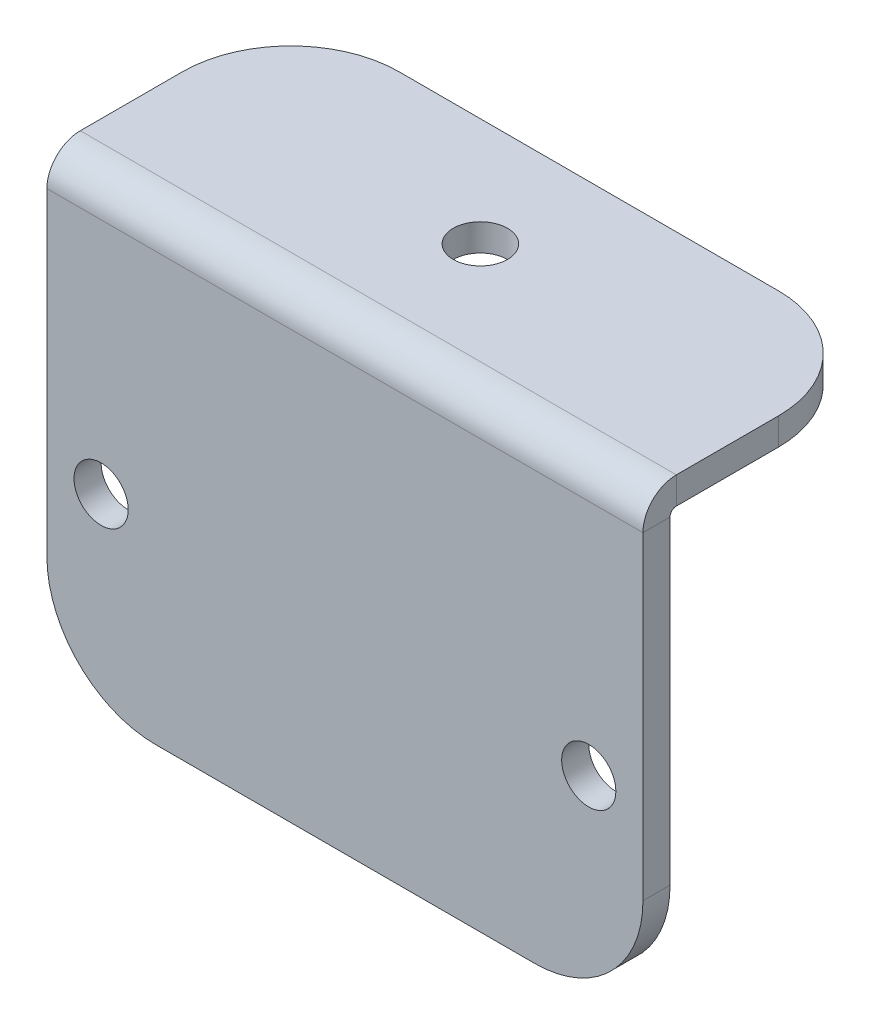
ISO-10303-21;
HEADER;
FILE_DESCRIPTION(('STEP AP214'),'2;1');
FILE_NAME('part.step','',(''),(''),'','','');
FILE_SCHEMA(('AUTOMOTIVE_DESIGN { 1 0 10303 214 1 1 1 1 }'));
ENDSEC;
DATA;
#1=APPLICATION_CONTEXT('core data for automotive mechanical design processes');
#2=APPLICATION_PROTOCOL_DEFINITION('international standard','automotive_design',2000,#1);
#3=PRODUCT_CONTEXT('',#1,'mechanical');
#4=PRODUCT('Part','Part','',(#3));
#5=PRODUCT_RELATED_PRODUCT_CATEGORY('part','',(#4));
#6=PRODUCT_DEFINITION_FORMATION('','',#4);
#7=PRODUCT_DEFINITION_CONTEXT('part definition',#1,'design');
#8=PRODUCT_DEFINITION('design','',#6,#7);
#9=PRODUCT_DEFINITION_SHAPE('','',#8);
#10=(LENGTH_UNIT() NAMED_UNIT(*) SI_UNIT(.MILLI.,.METRE.));
#11=(NAMED_UNIT(*) PLANE_ANGLE_UNIT() SI_UNIT($,.RADIAN.));
#12=(NAMED_UNIT(*) SI_UNIT($,.STERADIAN.) SOLID_ANGLE_UNIT());
#13=UNCERTAINTY_MEASURE_WITH_UNIT(LENGTH_MEASURE(1.E-05),#10,'distance_accuracy_value','');
#14=(GEOMETRIC_REPRESENTATION_CONTEXT(3) GLOBAL_UNCERTAINTY_ASSIGNED_CONTEXT((#13)) GLOBAL_UNIT_ASSIGNED_CONTEXT((#10,
#11,#12)) REPRESENTATION_CONTEXT('',''));
#15=CARTESIAN_POINT('',(0.,0.,0.));
#16=DIRECTION('',(0.,0.,1.));
#17=DIRECTION('',(1.,0.,0.));
#18=AXIS2_PLACEMENT_3D('',#15,#16,#17);
#19=CARTESIAN_POINT('',(34.925,-0.7366,0.));
#20=DIRECTION('',(1.,0.,0.));
#21=DIRECTION('',(0.,0.,-1.));
#22=AXIS2_PLACEMENT_3D('',#19,#20,#21);
#23=PLANE('',#22);
#24=DIRECTION('',(0.,0.,1.));
#25=VECTOR('',#24,1.);
#26=CARTESIAN_POINT('',(34.925,-0.7366,0.));
#27=LINE('',#26,#25);
#28=CARTESIAN_POINT('',(34.925,-0.7366,0.));
#29=VERTEX_POINT('',#28);
#30=CARTESIAN_POINT('',(34.925,-0.736600000000001,3.175));
#31=VERTEX_POINT('',#30);
#32=EDGE_CURVE('E132',#29,#31,#27,.T.);
#33=ORIENTED_EDGE('',*,*,#32,.F.);
#34=CARTESIAN_POINT('',(34.925,-0.7366,-0.7366));
#35=DIRECTION('',(-1.,0.,0.));
#36=DIRECTION('',(0.,0.,1.));
#37=AXIS2_PLACEMENT_3D('',#34,#35,#36);
#38=CIRCLE('',#37,0.7366);
#39=CARTESIAN_POINT('',(34.925,0.,-0.7366));
#40=VERTEX_POINT('',#39);
#41=EDGE_CURVE('E136',#40,#29,#38,.F.);
#42=ORIENTED_EDGE('',*,*,#41,.F.);
#43=DIRECTION('',(0.,-1.,0.));
#44=VECTOR('',#43,1.);
#45=CARTESIAN_POINT('',(34.925,3.175,-0.736600000000001));
#46=LINE('',#45,#44);
#47=CARTESIAN_POINT('',(34.925,3.175,-0.736600000000001));
#48=VERTEX_POINT('',#47);
#49=EDGE_CURVE('E141',#48,#40,#46,.T.);
#50=ORIENTED_EDGE('',*,*,#49,.F.);
#51=CARTESIAN_POINT('',(34.925,-0.7366,-0.7366));
#52=DIRECTION('',(1.,0.,0.));
#53=DIRECTION('',(0.,0.,-1.));
#54=AXIS2_PLACEMENT_3D('',#51,#52,#53);
#55=CIRCLE('',#54,3.9116);
#56=EDGE_CURVE('E138',#48,#31,#55,.T.);
#57=ORIENTED_EDGE('',*,*,#56,.T.);
#58=EDGE_LOOP('',(#33,#42,#50,#57));
#59=FACE_BOUND('',#58,.T.);
#60=ADVANCED_FACE('F39',(#59),#23,.T.);
#61=CARTESIAN_POINT('',(34.925,3.175,-0.736600000000001));
#62=DIRECTION('',(1.,0.,0.));
#63=DIRECTION('',(0.,0.,-1.));
#64=AXIS2_PLACEMENT_3D('',#61,#62,#63);
#65=PLANE('',#64);
#66=DIRECTION('',(0.,-1.,0.));
#67=VECTOR('',#66,1.);
#68=CARTESIAN_POINT('',(34.925,0.,3.175));
#69=LINE('',#68,#67);
#70=CARTESIAN_POINT('',(34.925,-38.1,3.17499999999999));
#71=VERTEX_POINT('',#70);
#72=EDGE_CURVE('E156',#31,#71,#69,.T.);
#73=ORIENTED_EDGE('',*,*,#72,.T.);
#74=DIRECTION('',(0.,0.,1.));
#75=VECTOR('',#74,1.);
#76=CARTESIAN_POINT('',(34.925,-38.1,-0.736600000000001));
#77=LINE('',#76,#75);
#78=CARTESIAN_POINT('',(34.925,-38.1,0.));
#79=VERTEX_POINT('',#78);
#80=EDGE_CURVE('E62',#71,#79,#77,.F.);
#81=ORIENTED_EDGE('',*,*,#80,.T.);
#82=DIRECTION('',(0.,-1.,0.));
#83=VECTOR('',#82,1.);
#84=CARTESIAN_POINT('',(34.925,0.,0.));
#85=LINE('',#84,#83);
#86=EDGE_CURVE('E146',#29,#79,#85,.T.);
#87=ORIENTED_EDGE('',*,*,#86,.F.);
#88=ORIENTED_EDGE('',*,*,#32,.T.);
#89=EDGE_LOOP('',(#73,#81,#87,#88));
#90=FACE_BOUND('',#89,.T.);
#91=ADVANCED_FACE('F155',(#90),#65,.T.);
#92=CARTESIAN_POINT('',(-34.925,0.,-0.7366));
#93=DIRECTION('',(-1.,0.,0.));
#94=DIRECTION('',(0.,0.,1.));
#95=AXIS2_PLACEMENT_3D('',#92,#93,#94);
#96=PLANE('',#95);
#97=DIRECTION('',(0.,1.,0.));
#98=VECTOR('',#97,1.);
#99=CARTESIAN_POINT('',(-34.925,0.,-0.7366));
#100=LINE('',#99,#98);
#101=CARTESIAN_POINT('',(-34.925,0.,-0.7366));
#102=VERTEX_POINT('',#101);
#103=CARTESIAN_POINT('',(-34.925,3.175,-0.736600000000001));
#104=VERTEX_POINT('',#103);
#105=EDGE_CURVE('E202',#102,#104,#100,.T.);
#106=ORIENTED_EDGE('',*,*,#105,.F.);
#107=CARTESIAN_POINT('',(-34.925,-0.7366,-0.7366));
#108=DIRECTION('',(-1.,0.,0.));
#109=DIRECTION('',(0.,0.,1.));
#110=AXIS2_PLACEMENT_3D('',#107,#108,#109);
#111=CIRCLE('',#110,0.7366);
#112=CARTESIAN_POINT('',(-34.925,-0.7366,0.));
#113=VERTEX_POINT('',#112);
#114=EDGE_CURVE('E175',#102,#113,#111,.F.);
#115=ORIENTED_EDGE('',*,*,#114,.T.);
#116=DIRECTION('',(0.,0.,-1.));
#117=VECTOR('',#116,1.);
#118=CARTESIAN_POINT('',(-34.925,-0.736600000000001,3.175));
#119=LINE('',#118,#117);
#120=CARTESIAN_POINT('',(-34.925,-0.736600000000001,3.175));
#121=VERTEX_POINT('',#120);
#122=EDGE_CURVE('E200',#121,#113,#119,.T.);
#123=ORIENTED_EDGE('',*,*,#122,.F.);
#124=CARTESIAN_POINT('',(-34.925,-0.7366,-0.7366));
#125=DIRECTION('',(1.,0.,0.));
#126=DIRECTION('',(0.,0.,-1.));
#127=AXIS2_PLACEMENT_3D('',#124,#125,#126);
#128=CIRCLE('',#127,3.9116);
#129=EDGE_CURVE('E181',#104,#121,#128,.T.);
#130=ORIENTED_EDGE('',*,*,#129,.F.);
#131=EDGE_LOOP('',(#106,#115,#123,#130));
#132=FACE_BOUND('',#131,.T.);
#133=ADVANCED_FACE('F299',(#132),#96,.T.);
#134=CARTESIAN_POINT('',(-34.925,-0.736600000000001,3.175));
#135=DIRECTION('',(-1.,0.,0.));
#136=DIRECTION('',(0.,0.,1.));
#137=AXIS2_PLACEMENT_3D('',#134,#135,#136);
#138=PLANE('',#137);
#139=DIRECTION('',(0.,0.,-1.));
#140=VECTOR('',#139,1.);
#141=CARTESIAN_POINT('',(-34.925,3.175,-25.4));
#142=LINE('',#141,#140);
#143=CARTESIAN_POINT('',(-34.925,3.175,-12.7));
#144=VERTEX_POINT('',#143);
#145=EDGE_CURVE('E179',#144,#104,#142,.F.);
#146=ORIENTED_EDGE('',*,*,#145,.F.);
#147=DIRECTION('',(0.,-1.,0.));
#148=VECTOR('',#147,1.);
#149=CARTESIAN_POINT('',(-34.925,-0.736600000000001,-12.7));
#150=LINE('',#149,#148);
#151=CARTESIAN_POINT('',(-34.925,0.,-12.7));
#152=VERTEX_POINT('',#151);
#153=EDGE_CURVE('E228',#144,#152,#150,.T.);
#154=ORIENTED_EDGE('',*,*,#153,.T.);
#155=DIRECTION('',(0.,0.,1.));
#156=VECTOR('',#155,1.);
#157=CARTESIAN_POINT('',(-34.925,0.,-25.4));
#158=LINE('',#157,#156);
#159=EDGE_CURVE('E177',#152,#102,#158,.T.);
#160=ORIENTED_EDGE('',*,*,#159,.T.);
#161=ORIENTED_EDGE('',*,*,#105,.T.);
#162=EDGE_LOOP('',(#146,#154,#160,#161));
#163=FACE_BOUND('',#162,.T.);
#164=ADVANCED_FACE('F294',(#163),#138,.T.);
#165=CARTESIAN_POINT('',(34.925,0.,3.175));
#166=DIRECTION('',(0.,0.,-1.));
#167=DIRECTION('',(0.,1.,0.));
#168=AXIS2_PLACEMENT_3D('',#165,#166,#167);
#169=PLANE('',#168);
#170=CARTESIAN_POINT('',(28.575,-28.575,3.175));
#171=DIRECTION('',(0.,0.,1.));
#172=DIRECTION('',(1.,0.,0.));
#173=AXIS2_PLACEMENT_3D('',#170,#171,#172);
#174=CIRCLE('',#173,3.175);
#175=CARTESIAN_POINT('',(31.75,-28.575,3.175));
#176=VERTEX_POINT('',#175);
#177=EDGE_CURVE('E213',#176,#176,#174,.T.);
#178=ORIENTED_EDGE('',*,*,#177,.F.);
#179=EDGE_LOOP('',(#178));
#180=FACE_BOUND('',#179,.T.);
#181=CARTESIAN_POINT('',(-28.575,-28.575,3.175));
#182=DIRECTION('',(0.,0.,1.));
#183=DIRECTION('',(1.,0.,0.));
#184=AXIS2_PLACEMENT_3D('',#181,#182,#183);
#185=CIRCLE('',#184,3.175);
#186=CARTESIAN_POINT('',(-25.4,-28.575,3.175));
#187=VERTEX_POINT('',#186);
#188=EDGE_CURVE('E209',#187,#187,#185,.T.);
#189=ORIENTED_EDGE('',*,*,#188,.F.);
#190=EDGE_LOOP('',(#189));
#191=FACE_BOUND('',#190,.T.);
#192=DIRECTION('',(-1.,0.,0.));
#193=VECTOR('',#192,1.);
#194=CARTESIAN_POINT('',(34.925,-50.8,3.17499999999999));
#195=LINE('',#194,#193);
#196=CARTESIAN_POINT('',(22.225,-50.8,3.17499999999999));
#197=VERTEX_POINT('',#196);
#198=CARTESIAN_POINT('',(-22.225,-50.8,3.17499999999999));
#199=VERTEX_POINT('',#198);
#200=EDGE_CURVE('E197',#197,#199,#195,.T.);
#201=ORIENTED_EDGE('',*,*,#200,.F.);
#202=CARTESIAN_POINT('',(22.225,-38.1,3.17499999999999));
#203=DIRECTION('',(0.,0.,-1.));
#204=DIRECTION('',(0.,1.,0.));
#205=AXIS2_PLACEMENT_3D('',#202,#203,#204);
#206=CIRCLE('',#205,12.7);
#207=EDGE_CURVE('E238',#197,#71,#206,.F.);
#208=ORIENTED_EDGE('',*,*,#207,.T.);
#209=ORIENTED_EDGE('',*,*,#72,.F.);
#210=DIRECTION('',(-1.,0.,0.));
#211=VECTOR('',#210,1.);
#212=CARTESIAN_POINT('',(34.925,-0.736600000000001,3.175));
#213=LINE('',#212,#211);
#214=EDGE_CURVE('E169',#31,#121,#213,.T.);
#215=ORIENTED_EDGE('',*,*,#214,.T.);
#216=DIRECTION('',(0.,-1.,0.));
#217=VECTOR('',#216,1.);
#218=CARTESIAN_POINT('',(-34.925,0.,3.175));
#219=LINE('',#218,#217);
#220=CARTESIAN_POINT('',(-34.925,-38.1,3.17499999999999));
#221=VERTEX_POINT('',#220);
#222=EDGE_CURVE('E170',#121,#221,#219,.T.);
#223=ORIENTED_EDGE('',*,*,#222,.T.);
#224=CARTESIAN_POINT('',(-22.225,-38.1,3.175));
#225=DIRECTION('',(0.,0.,-1.));
#226=DIRECTION('',(0.,1.,0.));
#227=AXIS2_PLACEMENT_3D('',#224,#225,#226);
#228=CIRCLE('',#227,12.7);
#229=EDGE_CURVE('E236',#221,#199,#228,.F.);
#230=ORIENTED_EDGE('',*,*,#229,.T.);
#231=EDGE_LOOP('',(#201,#208,#209,#215,#223,#230));
#232=FACE_BOUND('',#231,.T.);
#233=ADVANCED_FACE('F251',(#180,#191,#232),#169,.F.);
#234=CARTESIAN_POINT('',(34.925,-50.8,0.));
#235=DIRECTION('',(0.,-1.,0.));
#236=DIRECTION('',(0.,0.,-1.));
#237=AXIS2_PLACEMENT_3D('',#234,#235,#236);
#238=PLANE('',#237);
#239=DIRECTION('',(-1.,0.,0.));
#240=VECTOR('',#239,1.);
#241=CARTESIAN_POINT('',(34.925,-50.8,0.));
#242=LINE('',#241,#240);
#243=CARTESIAN_POINT('',(22.225,-50.8,0.));
#244=VERTEX_POINT('',#243);
#245=CARTESIAN_POINT('',(-22.225,-50.8,0.));
#246=VERTEX_POINT('',#245);
#247=EDGE_CURVE('E152',#244,#246,#242,.T.);
#248=ORIENTED_EDGE('',*,*,#247,.F.);
#249=DIRECTION('',(0.,0.,1.));
#250=VECTOR('',#249,1.);
#251=CARTESIAN_POINT('',(22.225,-50.8,0.));
#252=LINE('',#251,#250);
#253=EDGE_CURVE('E233',#244,#197,#252,.T.);
#254=ORIENTED_EDGE('',*,*,#253,.T.);
#255=ORIENTED_EDGE('',*,*,#200,.T.);
#256=DIRECTION('',(0.,0.,1.));
#257=VECTOR('',#256,1.);
#258=CARTESIAN_POINT('',(-22.225,-50.8,0.));
#259=LINE('',#258,#257);
#260=EDGE_CURVE('E231',#199,#246,#259,.F.);
#261=ORIENTED_EDGE('',*,*,#260,.T.);
#262=EDGE_LOOP('',(#248,#254,#255,#261));
#263=FACE_BOUND('',#262,.T.);
#264=ADVANCED_FACE('F245',(#263),#238,.T.);
#265=CARTESIAN_POINT('',(34.925,0.,0.));
#266=DIRECTION('',(0.,0.,-1.));
#267=DIRECTION('',(0.,1.,0.));
#268=AXIS2_PLACEMENT_3D('',#265,#266,#267);
#269=PLANE('',#268);
#270=CARTESIAN_POINT('',(28.575,-28.575,0.));
#271=DIRECTION('',(0.,0.,-1.));
#272=DIRECTION('',(0.,1.,0.));
#273=AXIS2_PLACEMENT_3D('',#270,#271,#272);
#274=CIRCLE('',#273,3.175);
#275=CARTESIAN_POINT('',(28.575,-25.4,0.));
#276=VERTEX_POINT('',#275);
#277=EDGE_CURVE('E210',#276,#276,#274,.T.);
#278=ORIENTED_EDGE('',*,*,#277,.F.);
#279=EDGE_LOOP('',(#278));
#280=FACE_BOUND('',#279,.T.);
#281=CARTESIAN_POINT('',(-28.575,-28.575,0.));
#282=DIRECTION('',(0.,0.,-1.));
#283=DIRECTION('',(0.,1.,0.));
#284=AXIS2_PLACEMENT_3D('',#281,#282,#283);
#285=CIRCLE('',#284,3.175);
#286=CARTESIAN_POINT('',(-28.575,-25.4,0.));
#287=VERTEX_POINT('',#286);
#288=EDGE_CURVE('E173',#287,#287,#285,.T.);
#289=ORIENTED_EDGE('',*,*,#288,.F.);
#290=EDGE_LOOP('',(#289));
#291=FACE_BOUND('',#290,.T.);
#292=ORIENTED_EDGE('',*,*,#86,.T.);
#293=CARTESIAN_POINT('',(22.225,-38.1,0.));
#294=DIRECTION('',(0.,0.,-1.));
#295=DIRECTION('',(0.,1.,0.));
#296=AXIS2_PLACEMENT_3D('',#293,#294,#295);
#297=CIRCLE('',#296,12.7);
#298=EDGE_CURVE('E47',#79,#244,#297,.T.);
#299=ORIENTED_EDGE('',*,*,#298,.T.);
#300=ORIENTED_EDGE('',*,*,#247,.T.);
#301=CARTESIAN_POINT('',(-22.225,-38.1,0.));
#302=DIRECTION('',(0.,0.,-1.));
#303=DIRECTION('',(0.,1.,0.));
#304=AXIS2_PLACEMENT_3D('',#301,#302,#303);
#305=CIRCLE('',#304,12.7);
#306=CARTESIAN_POINT('',(-34.925,-38.1,0.));
#307=VERTEX_POINT('',#306);
#308=EDGE_CURVE('E54',#246,#307,#305,.T.);
#309=ORIENTED_EDGE('',*,*,#308,.T.);
#310=DIRECTION('',(0.,-1.,0.));
#311=VECTOR('',#310,1.);
#312=CARTESIAN_POINT('',(-34.925,0.,0.));
#313=LINE('',#312,#311);
#314=EDGE_CURVE('E148',#113,#307,#313,.T.);
#315=ORIENTED_EDGE('',*,*,#314,.F.);
#316=DIRECTION('',(-1.,0.,0.));
#317=VECTOR('',#316,1.);
#318=CARTESIAN_POINT('',(34.925,-0.7366,0.));
#319=LINE('',#318,#317);
#320=EDGE_CURVE('E144',#29,#113,#319,.T.);
#321=ORIENTED_EDGE('',*,*,#320,.F.);
#322=EDGE_LOOP('',(#292,#299,#300,#309,#315,#321));
#323=FACE_BOUND('',#322,.T.);
#324=ADVANCED_FACE('F145',(#280,#291,#323),#269,.T.);
#325=CARTESIAN_POINT('',(34.925,-0.7366,-0.7366));
#326=DIRECTION('',(-1.,0.,0.));
#327=DIRECTION('',(0.,0.,1.));
#328=AXIS2_PLACEMENT_3D('',#325,#326,#327);
#329=CYLINDRICAL_SURFACE('',#328,0.7366);
#330=ORIENTED_EDGE('',*,*,#114,.F.);
#331=DIRECTION('',(-1.,0.,0.));
#332=VECTOR('',#331,1.);
#333=CARTESIAN_POINT('',(34.925,0.,-0.7366));
#334=LINE('',#333,#332);
#335=EDGE_CURVE('E153',#40,#102,#334,.T.);
#336=ORIENTED_EDGE('',*,*,#335,.F.);
#337=ORIENTED_EDGE('',*,*,#41,.T.);
#338=ORIENTED_EDGE('',*,*,#320,.T.);
#339=EDGE_LOOP('',(#330,#336,#337,#338));
#340=FACE_BOUND('',#339,.T.);
#341=ADVANCED_FACE('F159',(#340),#329,.F.);
#342=CARTESIAN_POINT('',(34.925,0.,-25.4));
#343=DIRECTION('',(0.,-1.,0.));
#344=DIRECTION('',(0.,0.,-1.));
#345=AXIS2_PLACEMENT_3D('',#342,#343,#344);
#346=PLANE('',#345);
#347=CARTESIAN_POINT('',(0.,0.,-12.7));
#348=DIRECTION('',(0.,-1.,0.));
#349=DIRECTION('',(0.,0.,-1.));
#350=AXIS2_PLACEMENT_3D('',#347,#348,#349);
#351=CIRCLE('',#350,3.175);
#352=CARTESIAN_POINT('',(0.,0.,-15.875));
#353=VERTEX_POINT('',#352);
#354=EDGE_CURVE('E257',#353,#353,#351,.T.);
#355=ORIENTED_EDGE('',*,*,#354,.F.);
#356=EDGE_LOOP('',(#355));
#357=FACE_BOUND('',#356,.T.);
#358=DIRECTION('',(-1.,0.,0.));
#359=VECTOR('',#358,1.);
#360=CARTESIAN_POINT('',(34.925,0.,-25.4));
#361=LINE('',#360,#359);
#362=CARTESIAN_POINT('',(22.225,0.,-25.4));
#363=VERTEX_POINT('',#362);
#364=CARTESIAN_POINT('',(-22.225,0.,-25.4));
#365=VERTEX_POINT('',#364);
#366=EDGE_CURVE('E192',#363,#365,#361,.T.);
#367=ORIENTED_EDGE('',*,*,#366,.F.);
#368=CARTESIAN_POINT('',(22.225,0.,-12.7));
#369=DIRECTION('',(0.,-1.,0.));
#370=DIRECTION('',(0.,0.,-1.));
#371=AXIS2_PLACEMENT_3D('',#368,#369,#370);
#372=CIRCLE('',#371,12.7);
#373=CARTESIAN_POINT('',(34.925,0.,-12.7));
#374=VERTEX_POINT('',#373);
#375=EDGE_CURVE('E220',#363,#374,#372,.T.);
#376=ORIENTED_EDGE('',*,*,#375,.T.);
#377=DIRECTION('',(0.,0.,1.));
#378=VECTOR('',#377,1.);
#379=CARTESIAN_POINT('',(34.925,0.,-25.4));
#380=LINE('',#379,#378);
#381=EDGE_CURVE('E161',#374,#40,#380,.T.);
#382=ORIENTED_EDGE('',*,*,#381,.T.);
#383=ORIENTED_EDGE('',*,*,#335,.T.);
#384=ORIENTED_EDGE('',*,*,#159,.F.);
#385=CARTESIAN_POINT('',(-22.225,0.,-12.7));
#386=DIRECTION('',(0.,-1.,0.));
#387=DIRECTION('',(0.,0.,-1.));
#388=AXIS2_PLACEMENT_3D('',#385,#386,#387);
#389=CIRCLE('',#388,12.7);
#390=EDGE_CURVE('E218',#152,#365,#389,.T.);
#391=ORIENTED_EDGE('',*,*,#390,.T.);
#392=EDGE_LOOP('',(#367,#376,#382,#383,#384,#391));
#393=FACE_BOUND('',#392,.T.);
#394=ADVANCED_FACE('F285',(#357,#393),#346,.T.);
#395=CARTESIAN_POINT('',(34.925,3.175,-25.4));
#396=DIRECTION('',(0.,0.,-1.));
#397=DIRECTION('',(-1.,0.,0.));
#398=AXIS2_PLACEMENT_3D('',#395,#396,#397);
#399=PLANE('',#398);
#400=DIRECTION('',(-1.,0.,0.));
#401=VECTOR('',#400,1.);
#402=CARTESIAN_POINT('',(34.925,3.175,-25.4));
#403=LINE('',#402,#401);
#404=CARTESIAN_POINT('',(22.225,3.175,-25.4));
#405=VERTEX_POINT('',#404);
#406=CARTESIAN_POINT('',(-22.225,3.175,-25.4));
#407=VERTEX_POINT('',#406);
#408=EDGE_CURVE('E189',#405,#407,#403,.T.);
#409=ORIENTED_EDGE('',*,*,#408,.F.);
#410=DIRECTION('',(0.,-1.,0.));
#411=VECTOR('',#410,1.);
#412=CARTESIAN_POINT('',(22.225,0.,-25.4));
#413=LINE('',#412,#411);
#414=EDGE_CURVE('E215',#405,#363,#413,.T.);
#415=ORIENTED_EDGE('',*,*,#414,.T.);
#416=ORIENTED_EDGE('',*,*,#366,.T.);
#417=DIRECTION('',(0.,-1.,0.));
#418=VECTOR('',#417,1.);
#419=CARTESIAN_POINT('',(-22.225,3.175,-25.4));
#420=LINE('',#419,#418);
#421=EDGE_CURVE('E140',#365,#407,#420,.F.);
#422=ORIENTED_EDGE('',*,*,#421,.T.);
#423=EDGE_LOOP('',(#409,#415,#416,#422));
#424=FACE_BOUND('',#423,.T.);
#425=ADVANCED_FACE('F270',(#424),#399,.T.);
#426=CARTESIAN_POINT('',(34.925,3.175,-25.4));
#427=DIRECTION('',(0.,-1.,0.));
#428=DIRECTION('',(0.,0.,-1.));
#429=AXIS2_PLACEMENT_3D('',#426,#427,#428);
#430=PLANE('',#429);
#431=CARTESIAN_POINT('',(0.,3.175,-12.7));
#432=DIRECTION('',(0.,1.,0.));
#433=DIRECTION('',(0.,0.,1.));
#434=AXIS2_PLACEMENT_3D('',#431,#432,#433);
#435=CIRCLE('',#434,3.175);
#436=CARTESIAN_POINT('',(0.,3.175,-9.525));
#437=VERTEX_POINT('',#436);
#438=EDGE_CURVE('E260',#437,#437,#435,.T.);
#439=ORIENTED_EDGE('',*,*,#438,.F.);
#440=EDGE_LOOP('',(#439));
#441=FACE_BOUND('',#440,.T.);
#442=DIRECTION('',(0.,0.,-1.));
#443=VECTOR('',#442,1.);
#444=CARTESIAN_POINT('',(34.925,3.175,-25.4));
#445=LINE('',#444,#443);
#446=CARTESIAN_POINT('',(34.925,3.175,-12.7));
#447=VERTEX_POINT('',#446);
#448=EDGE_CURVE('E163',#447,#48,#445,.F.);
#449=ORIENTED_EDGE('',*,*,#448,.F.);
#450=CARTESIAN_POINT('',(22.225,3.175,-12.7));
#451=DIRECTION('',(0.,-1.,0.));
#452=DIRECTION('',(0.,0.,-1.));
#453=AXIS2_PLACEMENT_3D('',#450,#451,#452);
#454=CIRCLE('',#453,12.7);
#455=EDGE_CURVE('E226',#447,#405,#454,.F.);
#456=ORIENTED_EDGE('',*,*,#455,.T.);
#457=ORIENTED_EDGE('',*,*,#408,.T.);
#458=CARTESIAN_POINT('',(-22.225,3.175,-12.7));
#459=DIRECTION('',(0.,-1.,0.));
#460=DIRECTION('',(0.,0.,-1.));
#461=AXIS2_PLACEMENT_3D('',#458,#459,#460);
#462=CIRCLE('',#461,12.7);
#463=EDGE_CURVE('E224',#407,#144,#462,.F.);
#464=ORIENTED_EDGE('',*,*,#463,.T.);
#465=ORIENTED_EDGE('',*,*,#145,.T.);
#466=DIRECTION('',(-1.,0.,0.));
#467=VECTOR('',#466,1.);
#468=CARTESIAN_POINT('',(34.925,3.175,-0.736600000000001));
#469=LINE('',#468,#467);
#470=EDGE_CURVE('E186',#48,#104,#469,.T.);
#471=ORIENTED_EDGE('',*,*,#470,.F.);
#472=EDGE_LOOP('',(#449,#456,#457,#464,#465,#471));
#473=FACE_BOUND('',#472,.T.);
#474=ADVANCED_FACE('F266',(#441,#473),#430,.F.);
#475=CARTESIAN_POINT('',(34.925,-0.7366,-0.7366));
#476=DIRECTION('',(-1.,0.,0.));
#477=DIRECTION('',(0.,0.,1.));
#478=AXIS2_PLACEMENT_3D('',#475,#476,#477);
#479=CYLINDRICAL_SURFACE('',#478,3.9116);
#480=ORIENTED_EDGE('',*,*,#129,.T.);
#481=ORIENTED_EDGE('',*,*,#214,.F.);
#482=ORIENTED_EDGE('',*,*,#56,.F.);
#483=ORIENTED_EDGE('',*,*,#470,.T.);
#484=EDGE_LOOP('',(#480,#481,#482,#483));
#485=FACE_BOUND('',#484,.T.);
#486=ADVANCED_FACE('F269',(#485),#479,.T.);
#487=CARTESIAN_POINT('',(34.925,-0.7366,-0.7366));
#488=DIRECTION('',(-1.,0.,0.));
#489=DIRECTION('',(0.,0.,1.));
#490=AXIS2_PLACEMENT_3D('',#487,#488,#489);
#491=PLANE('',#490);
#492=ORIENTED_EDGE('',*,*,#381,.F.);
#493=DIRECTION('',(0.,-1.,0.));
#494=VECTOR('',#493,1.);
#495=CARTESIAN_POINT('',(34.925,3.175,-12.7));
#496=LINE('',#495,#494);
#497=EDGE_CURVE('E222',#374,#447,#496,.F.);
#498=ORIENTED_EDGE('',*,*,#497,.T.);
#499=ORIENTED_EDGE('',*,*,#448,.T.);
#500=ORIENTED_EDGE('',*,*,#49,.T.);
#501=EDGE_LOOP('',(#492,#498,#499,#500));
#502=FACE_BOUND('',#501,.T.);
#503=ADVANCED_FACE('F401',(#502),#491,.F.);
#504=CARTESIAN_POINT('',(-34.925,-0.7366,-0.7366));
#505=DIRECTION('',(-1.,0.,0.));
#506=DIRECTION('',(0.,0.,1.));
#507=AXIS2_PLACEMENT_3D('',#504,#505,#506);
#508=PLANE('',#507);
#509=ORIENTED_EDGE('',*,*,#314,.T.);
#510=DIRECTION('',(0.,0.,1.));
#511=VECTOR('',#510,1.);
#512=CARTESIAN_POINT('',(-34.925,-38.1,-0.7366));
#513=LINE('',#512,#511);
#514=EDGE_CURVE('E11',#307,#221,#513,.T.);
#515=ORIENTED_EDGE('',*,*,#514,.T.);
#516=ORIENTED_EDGE('',*,*,#222,.F.);
#517=ORIENTED_EDGE('',*,*,#122,.T.);
#518=EDGE_LOOP('',(#509,#515,#516,#517));
#519=FACE_BOUND('',#518,.T.);
#520=ADVANCED_FACE('F302',(#519),#508,.T.);
#521=CARTESIAN_POINT('',(-28.575,-28.575,-25.4));
#522=DIRECTION('',(0.,0.,1.));
#523=DIRECTION('',(1.,0.,0.));
#524=AXIS2_PLACEMENT_3D('',#521,#522,#523);
#525=CYLINDRICAL_SURFACE('',#524,3.175);
#526=ORIENTED_EDGE('',*,*,#288,.T.);
#527=EDGE_LOOP('',(#526));
#528=FACE_BOUND('',#527,.T.);
#529=ORIENTED_EDGE('',*,*,#188,.T.);
#530=EDGE_LOOP('',(#529));
#531=FACE_BOUND('',#530,.T.);
#532=ADVANCED_FACE('F367',(#528,#531),#525,.F.);
#533=CARTESIAN_POINT('',(28.575,-28.575,-25.4));
#534=DIRECTION('',(0.,0.,1.));
#535=DIRECTION('',(1.,0.,0.));
#536=AXIS2_PLACEMENT_3D('',#533,#534,#535);
#537=CYLINDRICAL_SURFACE('',#536,3.175);
#538=ORIENTED_EDGE('',*,*,#277,.T.);
#539=EDGE_LOOP('',(#538));
#540=FACE_BOUND('',#539,.T.);
#541=ORIENTED_EDGE('',*,*,#177,.T.);
#542=EDGE_LOOP('',(#541));
#543=FACE_BOUND('',#542,.T.);
#544=ADVANCED_FACE('F322',(#540,#543),#537,.F.);
#545=CARTESIAN_POINT('',(22.225,3.175,-12.7));
#546=DIRECTION('',(0.,1.,0.));
#547=DIRECTION('',(0.,0.,1.));
#548=AXIS2_PLACEMENT_3D('',#545,#546,#547);
#549=CYLINDRICAL_SURFACE('',#548,12.7);
#550=ORIENTED_EDGE('',*,*,#455,.F.);
#551=ORIENTED_EDGE('',*,*,#497,.F.);
#552=ORIENTED_EDGE('',*,*,#375,.F.);
#553=ORIENTED_EDGE('',*,*,#414,.F.);
#554=EDGE_LOOP('',(#550,#551,#552,#553));
#555=FACE_BOUND('',#554,.T.);
#556=ADVANCED_FACE('F280',(#555),#549,.T.);
#557=CARTESIAN_POINT('',(-22.225,-0.736600000000001,-12.7));
#558=DIRECTION('',(0.,-1.,0.));
#559=DIRECTION('',(0.,0.,-1.));
#560=AXIS2_PLACEMENT_3D('',#557,#558,#559);
#561=CYLINDRICAL_SURFACE('',#560,12.7);
#562=ORIENTED_EDGE('',*,*,#463,.F.);
#563=ORIENTED_EDGE('',*,*,#421,.F.);
#564=ORIENTED_EDGE('',*,*,#390,.F.);
#565=ORIENTED_EDGE('',*,*,#153,.F.);
#566=EDGE_LOOP('',(#562,#563,#564,#565));
#567=FACE_BOUND('',#566,.T.);
#568=ADVANCED_FACE('F291',(#567),#561,.T.);
#569=CARTESIAN_POINT('',(22.225,-38.1,0.));
#570=DIRECTION('',(0.,0.,1.));
#571=DIRECTION('',(1.,0.,0.));
#572=AXIS2_PLACEMENT_3D('',#569,#570,#571);
#573=CYLINDRICAL_SURFACE('',#572,12.7);
#574=ORIENTED_EDGE('',*,*,#298,.F.);
#575=ORIENTED_EDGE('',*,*,#80,.F.);
#576=ORIENTED_EDGE('',*,*,#207,.F.);
#577=ORIENTED_EDGE('',*,*,#253,.F.);
#578=EDGE_LOOP('',(#574,#575,#576,#577));
#579=FACE_BOUND('',#578,.T.);
#580=ADVANCED_FACE('F248',(#579),#573,.T.);
#581=CARTESIAN_POINT('',(-22.225,-38.1,-0.7366));
#582=DIRECTION('',(0.,0.,1.));
#583=DIRECTION('',(1.,0.,0.));
#584=AXIS2_PLACEMENT_3D('',#581,#582,#583);
#585=CYLINDRICAL_SURFACE('',#584,12.7);
#586=ORIENTED_EDGE('',*,*,#308,.F.);
#587=ORIENTED_EDGE('',*,*,#260,.F.);
#588=ORIENTED_EDGE('',*,*,#229,.F.);
#589=ORIENTED_EDGE('',*,*,#514,.F.);
#590=EDGE_LOOP('',(#586,#587,#588,#589));
#591=FACE_BOUND('',#590,.T.);
#592=ADVANCED_FACE('F41',(#591),#585,.T.);
#593=CARTESIAN_POINT('',(0.,-50.8,-12.7));
#594=DIRECTION('',(0.,1.,0.));
#595=DIRECTION('',(0.,0.,1.));
#596=AXIS2_PLACEMENT_3D('',#593,#594,#595);
#597=CYLINDRICAL_SURFACE('',#596,3.175);
#598=ORIENTED_EDGE('',*,*,#354,.T.);
#599=EDGE_LOOP('',(#598));
#600=FACE_BOUND('',#599,.T.);
#601=ORIENTED_EDGE('',*,*,#438,.T.);
#602=EDGE_LOOP('',(#601));
#603=FACE_BOUND('',#602,.T.);
#604=ADVANCED_FACE('F264',(#600,#603),#597,.F.);
#605=CLOSED_SHELL('',(#60,#91,#133,#164,#233,#264,#324,#341,#394,#425,#474,#486,#503,#520,#532,
#544,#556,#568,#580,#592,#604));
#606=MANIFOLD_SOLID_BREP('B2',#605);
#607=ADVANCED_BREP_SHAPE_REPRESENTATION('',(#18,#606),#14);
#608=SHAPE_DEFINITION_REPRESENTATION(#9,#607);
ENDSEC;
END-ISO-10303-21;
